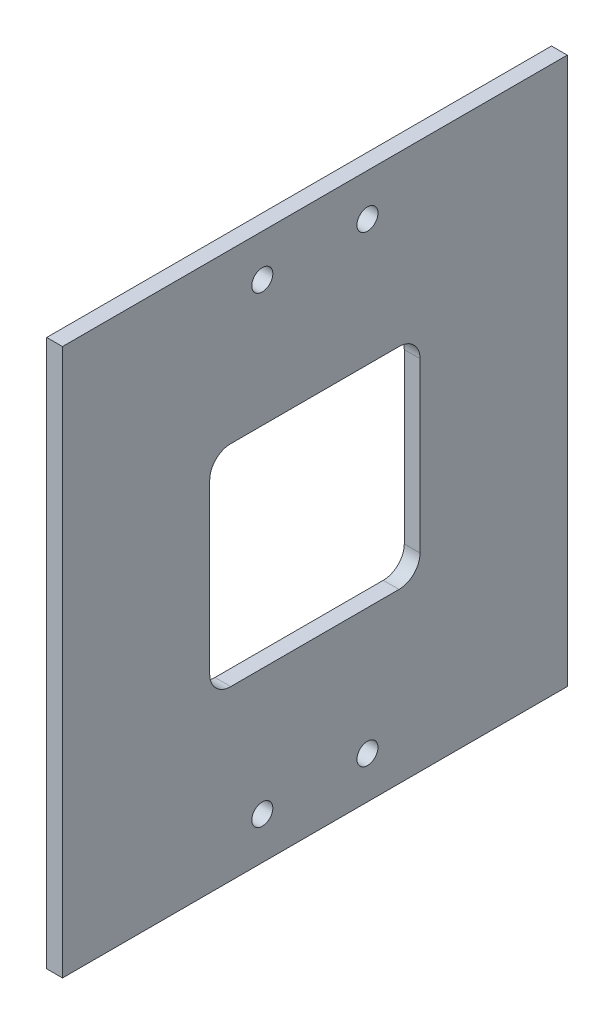
ISO-10303-21;
HEADER;
FILE_DESCRIPTION(('STEP AP214'),'2;1');
FILE_NAME('part.step','',(''),(''),'','','');
FILE_SCHEMA(('AUTOMOTIVE_DESIGN { 1 0 10303 214 1 1 1 1 }'));
ENDSEC;
DATA;
#1=APPLICATION_CONTEXT('core data for automotive mechanical design processes');
#2=APPLICATION_PROTOCOL_DEFINITION('international standard','automotive_design',2000,#1);
#3=PRODUCT_CONTEXT('',#1,'mechanical');
#4=PRODUCT('Part','Part','',(#3));
#5=PRODUCT_RELATED_PRODUCT_CATEGORY('part','',(#4));
#6=PRODUCT_DEFINITION_FORMATION('','',#4);
#7=PRODUCT_DEFINITION_CONTEXT('part definition',#1,'design');
#8=PRODUCT_DEFINITION('design','',#6,#7);
#9=PRODUCT_DEFINITION_SHAPE('','',#8);
#10=(LENGTH_UNIT() NAMED_UNIT(*) SI_UNIT(.MILLI.,.METRE.));
#11=(NAMED_UNIT(*) PLANE_ANGLE_UNIT() SI_UNIT($,.RADIAN.));
#12=(NAMED_UNIT(*) SI_UNIT($,.STERADIAN.) SOLID_ANGLE_UNIT());
#13=UNCERTAINTY_MEASURE_WITH_UNIT(LENGTH_MEASURE(1.E-05),#10,'distance_accuracy_value','');
#14=(GEOMETRIC_REPRESENTATION_CONTEXT(3) GLOBAL_UNCERTAINTY_ASSIGNED_CONTEXT((#13)) GLOBAL_UNIT_ASSIGNED_CONTEXT((#10,
#11,#12)) REPRESENTATION_CONTEXT('',''));
#15=CARTESIAN_POINT('',(0.,0.,0.));
#16=DIRECTION('',(0.,0.,1.));
#17=DIRECTION('',(1.,0.,0.));
#18=AXIS2_PLACEMENT_3D('',#15,#16,#17);
#19=CARTESIAN_POINT('',(4.7625,82.55,0.));
#20=DIRECTION('',(0.,0.,-1.));
#21=DIRECTION('',(0.,1.,0.));
#22=AXIS2_PLACEMENT_3D('',#19,#20,#21);
#23=PLANE('',#22);
#24=DIRECTION('',(0.,-1.,0.));
#25=VECTOR('',#24,1.);
#26=CARTESIAN_POINT('',(0.,82.55,0.));
#27=LINE('',#26,#25);
#28=CARTESIAN_POINT('',(0.,82.55,0.));
#29=VERTEX_POINT('',#28);
#30=CARTESIAN_POINT('',(0.,-82.55,0.));
#31=VERTEX_POINT('',#30);
#32=EDGE_CURVE('E207',#29,#31,#27,.T.);
#33=ORIENTED_EDGE('',*,*,#32,.T.);
#34=DIRECTION('',(-1.,0.,0.));
#35=VECTOR('',#34,1.);
#36=CARTESIAN_POINT('',(4.7625,-82.55,0.));
#37=LINE('',#36,#35);
#38=CARTESIAN_POINT('',(4.7625,-82.55,0.));
#39=VERTEX_POINT('',#38);
#40=EDGE_CURVE('E11',#39,#31,#37,.T.);
#41=ORIENTED_EDGE('',*,*,#40,.F.);
#42=DIRECTION('',(0.,-1.,0.));
#43=VECTOR('',#42,1.);
#44=CARTESIAN_POINT('',(4.7625,82.55,0.));
#45=LINE('',#44,#43);
#46=CARTESIAN_POINT('',(4.7625,82.55,0.));
#47=VERTEX_POINT('',#46);
#48=EDGE_CURVE('E222',#47,#39,#45,.T.);
#49=ORIENTED_EDGE('',*,*,#48,.F.);
#50=DIRECTION('',(-1.,0.,0.));
#51=VECTOR('',#50,1.);
#52=CARTESIAN_POINT('',(4.7625,82.55,0.));
#53=LINE('',#52,#51);
#54=EDGE_CURVE('E235',#47,#29,#53,.T.);
#55=ORIENTED_EDGE('',*,*,#54,.T.);
#56=EDGE_LOOP('',(#33,#41,#49,#55));
#57=FACE_BOUND('',#56,.T.);
#58=ADVANCED_FACE('F37',(#57),#23,.F.);
#59=CARTESIAN_POINT('',(4.7625,-82.55,-152.4));
#60=DIRECTION('',(0.,1.,0.));
#61=DIRECTION('',(0.,0.,1.));
#62=AXIS2_PLACEMENT_3D('',#59,#60,#61);
#63=PLANE('',#62);
#64=DIRECTION('',(0.,0.,-1.));
#65=VECTOR('',#64,1.);
#66=CARTESIAN_POINT('',(0.,-82.55,-152.4));
#67=LINE('',#66,#65);
#68=CARTESIAN_POINT('',(0.,-82.55,-152.4));
#69=VERTEX_POINT('',#68);
#70=EDGE_CURVE('E239',#31,#69,#67,.T.);
#71=ORIENTED_EDGE('',*,*,#70,.T.);
#72=DIRECTION('',(-1.,0.,0.));
#73=VECTOR('',#72,1.);
#74=CARTESIAN_POINT('',(4.7625,-82.55,-152.4));
#75=LINE('',#74,#73);
#76=CARTESIAN_POINT('',(4.7625,-82.55,-152.4));
#77=VERTEX_POINT('',#76);
#78=EDGE_CURVE('E44',#77,#69,#75,.T.);
#79=ORIENTED_EDGE('',*,*,#78,.F.);
#80=DIRECTION('',(0.,0.,-1.));
#81=VECTOR('',#80,1.);
#82=CARTESIAN_POINT('',(4.7625,-82.55,-152.4));
#83=LINE('',#82,#81);
#84=EDGE_CURVE('E226',#39,#77,#83,.T.);
#85=ORIENTED_EDGE('',*,*,#84,.F.);
#86=ORIENTED_EDGE('',*,*,#40,.T.);
#87=EDGE_LOOP('',(#71,#79,#85,#86));
#88=FACE_BOUND('',#87,.T.);
#89=ADVANCED_FACE('F269',(#88),#63,.F.);
#90=CARTESIAN_POINT('',(4.7625,82.55,-152.4));
#91=DIRECTION('',(0.,0.,1.));
#92=DIRECTION('',(0.,-1.,0.));
#93=AXIS2_PLACEMENT_3D('',#90,#91,#92);
#94=PLANE('',#93);
#95=DIRECTION('',(0.,1.,0.));
#96=VECTOR('',#95,1.);
#97=CARTESIAN_POINT('',(0.,82.55,-152.4));
#98=LINE('',#97,#96);
#99=CARTESIAN_POINT('',(0.,82.55,-152.4));
#100=VERTEX_POINT('',#99);
#101=EDGE_CURVE('E242',#69,#100,#98,.T.);
#102=ORIENTED_EDGE('',*,*,#101,.T.);
#103=DIRECTION('',(-1.,0.,0.));
#104=VECTOR('',#103,1.);
#105=CARTESIAN_POINT('',(4.7625,82.55,-152.4));
#106=LINE('',#105,#104);
#107=CARTESIAN_POINT('',(4.7625,82.55,-152.4));
#108=VERTEX_POINT('',#107);
#109=EDGE_CURVE('E248',#108,#100,#106,.T.);
#110=ORIENTED_EDGE('',*,*,#109,.F.);
#111=DIRECTION('',(0.,1.,0.));
#112=VECTOR('',#111,1.);
#113=CARTESIAN_POINT('',(4.7625,82.55,-152.4));
#114=LINE('',#113,#112);
#115=EDGE_CURVE('E230',#77,#108,#114,.T.);
#116=ORIENTED_EDGE('',*,*,#115,.F.);
#117=ORIENTED_EDGE('',*,*,#78,.T.);
#118=EDGE_LOOP('',(#102,#110,#116,#117));
#119=FACE_BOUND('',#118,.T.);
#120=ADVANCED_FACE('F255',(#119),#94,.F.);
#121=CARTESIAN_POINT('',(4.7625,82.55,-152.4));
#122=DIRECTION('',(0.,-1.,0.));
#123=DIRECTION('',(0.,0.,-1.));
#124=AXIS2_PLACEMENT_3D('',#121,#122,#123);
#125=PLANE('',#124);
#126=DIRECTION('',(0.,0.,1.));
#127=VECTOR('',#126,1.);
#128=CARTESIAN_POINT('',(0.,82.55,-152.4));
#129=LINE('',#128,#127);
#130=EDGE_CURVE('E227',#100,#29,#129,.T.);
#131=ORIENTED_EDGE('',*,*,#130,.T.);
#132=ORIENTED_EDGE('',*,*,#54,.F.);
#133=DIRECTION('',(0.,0.,1.));
#134=VECTOR('',#133,1.);
#135=CARTESIAN_POINT('',(4.7625,82.55,-152.4));
#136=LINE('',#135,#134);
#137=EDGE_CURVE('E232',#108,#47,#136,.T.);
#138=ORIENTED_EDGE('',*,*,#137,.F.);
#139=ORIENTED_EDGE('',*,*,#109,.T.);
#140=EDGE_LOOP('',(#131,#132,#138,#139));
#141=FACE_BOUND('',#140,.T.);
#142=ADVANCED_FACE('F264',(#141),#125,.F.);
#143=CARTESIAN_POINT('',(4.7625,-82.55,0.));
#144=DIRECTION('',(-1.,0.,0.));
#145=DIRECTION('',(0.,0.,1.));
#146=AXIS2_PLACEMENT_3D('',#143,#144,#145);
#147=PLANE('',#146);
#148=CARTESIAN_POINT('',(4.7625,-69.85,-60.325));
#149=DIRECTION('',(-1.,0.,0.));
#150=DIRECTION('',(0.,0.,1.));
#151=AXIS2_PLACEMENT_3D('',#148,#149,#150);
#152=CIRCLE('',#151,3.175);
#153=CARTESIAN_POINT('',(4.7625,-69.85,-57.15));
#154=VERTEX_POINT('',#153);
#155=EDGE_CURVE('E332',#154,#154,#152,.T.);
#156=ORIENTED_EDGE('',*,*,#155,.T.);
#157=EDGE_LOOP('',(#156));
#158=FACE_BOUND('',#157,.T.);
#159=CARTESIAN_POINT('',(4.7625,-69.85,-92.075));
#160=DIRECTION('',(-1.,0.,0.));
#161=DIRECTION('',(0.,0.,1.));
#162=AXIS2_PLACEMENT_3D('',#159,#160,#161);
#163=CIRCLE('',#162,3.175);
#164=CARTESIAN_POINT('',(4.7625,-69.85,-88.9));
#165=VERTEX_POINT('',#164);
#166=EDGE_CURVE('E342',#165,#165,#163,.T.);
#167=ORIENTED_EDGE('',*,*,#166,.T.);
#168=EDGE_LOOP('',(#167));
#169=FACE_BOUND('',#168,.T.);
#170=CARTESIAN_POINT('',(4.7625,69.85,-92.075));
#171=DIRECTION('',(-1.,0.,0.));
#172=DIRECTION('',(0.,0.,1.));
#173=AXIS2_PLACEMENT_3D('',#170,#171,#172);
#174=CIRCLE('',#173,3.175);
#175=CARTESIAN_POINT('',(4.7625,69.85,-88.9));
#176=VERTEX_POINT('',#175);
#177=EDGE_CURVE('E349',#176,#176,#174,.T.);
#178=ORIENTED_EDGE('',*,*,#177,.T.);
#179=EDGE_LOOP('',(#178));
#180=FACE_BOUND('',#179,.T.);
#181=CARTESIAN_POINT('',(4.7625,69.85,-60.325));
#182=DIRECTION('',(-1.,0.,0.));
#183=DIRECTION('',(0.,0.,1.));
#184=AXIS2_PLACEMENT_3D('',#181,#182,#183);
#185=CIRCLE('',#184,3.175);
#186=CARTESIAN_POINT('',(4.7625,69.85,-57.15));
#187=VERTEX_POINT('',#186);
#188=EDGE_CURVE('E185',#187,#187,#185,.T.);
#189=ORIENTED_EDGE('',*,*,#188,.T.);
#190=EDGE_LOOP('',(#189));
#191=FACE_BOUND('',#190,.T.);
#192=CARTESIAN_POINT('',(4.7625,-25.4,-101.6));
#193=DIRECTION('',(-1.,0.,0.));
#194=DIRECTION('',(0.,0.,1.));
#195=AXIS2_PLACEMENT_3D('',#192,#193,#194);
#196=CIRCLE('',#195,6.35000000000001);
#197=CARTESIAN_POINT('',(4.7625,-25.4,-107.95));
#198=VERTEX_POINT('',#197);
#199=CARTESIAN_POINT('',(4.7625,-31.75,-101.6));
#200=VERTEX_POINT('',#199);
#201=EDGE_CURVE('E143',#198,#200,#196,.T.);
#202=ORIENTED_EDGE('',*,*,#201,.T.);
#203=DIRECTION('',(0.,0.,1.));
#204=VECTOR('',#203,1.);
#205=CARTESIAN_POINT('',(4.7625,-31.75,-76.2));
#206=LINE('',#205,#204);
#207=CARTESIAN_POINT('',(4.7625,-31.75,-50.8));
#208=VERTEX_POINT('',#207);
#209=EDGE_CURVE('E136',#200,#208,#206,.T.);
#210=ORIENTED_EDGE('',*,*,#209,.T.);
#211=CARTESIAN_POINT('',(4.7625,-25.4,-50.8));
#212=DIRECTION('',(-1.,0.,0.));
#213=DIRECTION('',(0.,0.,1.));
#214=AXIS2_PLACEMENT_3D('',#211,#212,#213);
#215=CIRCLE('',#214,6.35000000000001);
#216=CARTESIAN_POINT('',(4.7625,-25.4,-44.45));
#217=VERTEX_POINT('',#216);
#218=EDGE_CURVE('E146',#208,#217,#215,.T.);
#219=ORIENTED_EDGE('',*,*,#218,.T.);
#220=DIRECTION('',(0.,1.,0.));
#221=VECTOR('',#220,1.);
#222=CARTESIAN_POINT('',(4.7625,-174.906065520897,-44.45));
#223=LINE('',#222,#221);
#224=CARTESIAN_POINT('',(4.7625,25.4,-44.45));
#225=VERTEX_POINT('',#224);
#226=EDGE_CURVE('E54',#217,#225,#223,.T.);
#227=ORIENTED_EDGE('',*,*,#226,.T.);
#228=CARTESIAN_POINT('',(4.7625,25.4,-50.8));
#229=DIRECTION('',(-1.,0.,0.));
#230=DIRECTION('',(0.,0.,1.));
#231=AXIS2_PLACEMENT_3D('',#228,#229,#230);
#232=CIRCLE('',#231,6.35000000000001);
#233=CARTESIAN_POINT('',(4.7625,31.75,-50.8));
#234=VERTEX_POINT('',#233);
#235=EDGE_CURVE('E168',#225,#234,#232,.T.);
#236=ORIENTED_EDGE('',*,*,#235,.T.);
#237=DIRECTION('',(0.,0.,-1.));
#238=VECTOR('',#237,1.);
#239=CARTESIAN_POINT('',(4.7625,31.75,-76.2));
#240=LINE('',#239,#238);
#241=CARTESIAN_POINT('',(4.7625,31.75,-101.6));
#242=VERTEX_POINT('',#241);
#243=EDGE_CURVE('E172',#234,#242,#240,.T.);
#244=ORIENTED_EDGE('',*,*,#243,.T.);
#245=CARTESIAN_POINT('',(4.7625,25.4,-101.6));
#246=DIRECTION('',(-1.,0.,0.));
#247=DIRECTION('',(0.,0.,1.));
#248=AXIS2_PLACEMENT_3D('',#245,#246,#247);
#249=CIRCLE('',#248,6.35000000000001);
#250=CARTESIAN_POINT('',(4.7625,25.4,-107.95));
#251=VERTEX_POINT('',#250);
#252=EDGE_CURVE('E176',#242,#251,#249,.T.);
#253=ORIENTED_EDGE('',*,*,#252,.T.);
#254=DIRECTION('',(0.,-1.,0.));
#255=VECTOR('',#254,1.);
#256=CARTESIAN_POINT('',(4.7625,-174.906065520897,-107.95));
#257=LINE('',#256,#255);
#258=EDGE_CURVE('E179',#251,#198,#257,.T.);
#259=ORIENTED_EDGE('',*,*,#258,.T.);
#260=EDGE_LOOP('',(#202,#210,#219,#227,#236,#244,#253,#259));
#261=FACE_BOUND('',#260,.T.);
#262=ORIENTED_EDGE('',*,*,#48,.T.);
#263=ORIENTED_EDGE('',*,*,#84,.T.);
#264=ORIENTED_EDGE('',*,*,#115,.T.);
#265=ORIENTED_EDGE('',*,*,#137,.T.);
#266=EDGE_LOOP('',(#262,#263,#264,#265));
#267=FACE_BOUND('',#266,.T.);
#268=ADVANCED_FACE('F151',(#158,#169,#180,#191,#261,#267),#147,.F.);
#269=CARTESIAN_POINT('',(0.,-82.55,0.));
#270=DIRECTION('',(-1.,0.,0.));
#271=DIRECTION('',(0.,0.,1.));
#272=AXIS2_PLACEMENT_3D('',#269,#270,#271);
#273=PLANE('',#272);
#274=CARTESIAN_POINT('',(0.,-69.85,-60.325));
#275=DIRECTION('',(-1.,0.,0.));
#276=DIRECTION('',(0.,0.,1.));
#277=AXIS2_PLACEMENT_3D('',#274,#275,#276);
#278=CIRCLE('',#277,3.175);
#279=CARTESIAN_POINT('',(0.,-69.85,-57.15));
#280=VERTEX_POINT('',#279);
#281=EDGE_CURVE('E335',#280,#280,#278,.T.);
#282=ORIENTED_EDGE('',*,*,#281,.F.);
#283=EDGE_LOOP('',(#282));
#284=FACE_BOUND('',#283,.T.);
#285=CARTESIAN_POINT('',(0.,-69.85,-92.075));
#286=DIRECTION('',(-1.,0.,0.));
#287=DIRECTION('',(0.,0.,1.));
#288=AXIS2_PLACEMENT_3D('',#285,#286,#287);
#289=CIRCLE('',#288,3.175);
#290=CARTESIAN_POINT('',(0.,-69.85,-88.9));
#291=VERTEX_POINT('',#290);
#292=EDGE_CURVE('E339',#291,#291,#289,.T.);
#293=ORIENTED_EDGE('',*,*,#292,.F.);
#294=EDGE_LOOP('',(#293));
#295=FACE_BOUND('',#294,.T.);
#296=CARTESIAN_POINT('',(0.,69.85,-92.075));
#297=DIRECTION('',(-1.,0.,0.));
#298=DIRECTION('',(0.,0.,1.));
#299=AXIS2_PLACEMENT_3D('',#296,#297,#298);
#300=CIRCLE('',#299,3.175);
#301=CARTESIAN_POINT('',(0.,69.85,-88.9));
#302=VERTEX_POINT('',#301);
#303=EDGE_CURVE('E345',#302,#302,#300,.T.);
#304=ORIENTED_EDGE('',*,*,#303,.F.);
#305=EDGE_LOOP('',(#304));
#306=FACE_BOUND('',#305,.T.);
#307=CARTESIAN_POINT('',(0.,69.85,-60.325));
#308=DIRECTION('',(-1.,0.,0.));
#309=DIRECTION('',(0.,0.,1.));
#310=AXIS2_PLACEMENT_3D('',#307,#308,#309);
#311=CIRCLE('',#310,3.175);
#312=CARTESIAN_POINT('',(0.,69.85,-57.15));
#313=VERTEX_POINT('',#312);
#314=EDGE_CURVE('E163',#313,#313,#311,.T.);
#315=ORIENTED_EDGE('',*,*,#314,.F.);
#316=EDGE_LOOP('',(#315));
#317=FACE_BOUND('',#316,.T.);
#318=DIRECTION('',(0.,0.,1.));
#319=VECTOR('',#318,1.);
#320=CARTESIAN_POINT('',(0.,-31.75,-76.2));
#321=LINE('',#320,#319);
#322=CARTESIAN_POINT('',(0.,-31.75,-101.6));
#323=VERTEX_POINT('',#322);
#324=CARTESIAN_POINT('',(0.,-31.75,-50.8));
#325=VERTEX_POINT('',#324);
#326=EDGE_CURVE('E63',#323,#325,#321,.T.);
#327=ORIENTED_EDGE('',*,*,#326,.F.);
#328=CARTESIAN_POINT('',(0.,-25.4,-101.6));
#329=DIRECTION('',(-1.,0.,0.));
#330=DIRECTION('',(0.,0.,1.));
#331=AXIS2_PLACEMENT_3D('',#328,#329,#330);
#332=CIRCLE('',#331,6.35000000000001);
#333=CARTESIAN_POINT('',(0.,-25.4,-107.95));
#334=VERTEX_POINT('',#333);
#335=EDGE_CURVE('E156',#334,#323,#332,.T.);
#336=ORIENTED_EDGE('',*,*,#335,.F.);
#337=DIRECTION('',(0.,-1.,0.));
#338=VECTOR('',#337,1.);
#339=CARTESIAN_POINT('',(0.,-174.906065520897,-107.95));
#340=LINE('',#339,#338);
#341=CARTESIAN_POINT('',(0.,25.4,-107.95));
#342=VERTEX_POINT('',#341);
#343=EDGE_CURVE('E160',#342,#334,#340,.T.);
#344=ORIENTED_EDGE('',*,*,#343,.F.);
#345=CARTESIAN_POINT('',(0.,25.4,-101.6));
#346=DIRECTION('',(-1.,0.,0.));
#347=DIRECTION('',(0.,0.,1.));
#348=AXIS2_PLACEMENT_3D('',#345,#346,#347);
#349=CIRCLE('',#348,6.35000000000001);
#350=CARTESIAN_POINT('',(0.,31.75,-101.6));
#351=VERTEX_POINT('',#350);
#352=EDGE_CURVE('E200',#351,#342,#349,.T.);
#353=ORIENTED_EDGE('',*,*,#352,.F.);
#354=DIRECTION('',(0.,0.,-1.));
#355=VECTOR('',#354,1.);
#356=CARTESIAN_POINT('',(0.,31.75,-76.2));
#357=LINE('',#356,#355);
#358=CARTESIAN_POINT('',(0.,31.75,-50.8));
#359=VERTEX_POINT('',#358);
#360=EDGE_CURVE('E196',#359,#351,#357,.T.);
#361=ORIENTED_EDGE('',*,*,#360,.F.);
#362=CARTESIAN_POINT('',(0.,25.4,-50.8));
#363=DIRECTION('',(-1.,0.,0.));
#364=DIRECTION('',(0.,0.,1.));
#365=AXIS2_PLACEMENT_3D('',#362,#363,#364);
#366=CIRCLE('',#365,6.35000000000001);
#367=CARTESIAN_POINT('',(0.,25.4,-44.45));
#368=VERTEX_POINT('',#367);
#369=EDGE_CURVE('E192',#368,#359,#366,.T.);
#370=ORIENTED_EDGE('',*,*,#369,.F.);
#371=DIRECTION('',(0.,1.,0.));
#372=VECTOR('',#371,1.);
#373=CARTESIAN_POINT('',(0.,-174.906065520897,-44.45));
#374=LINE('',#373,#372);
#375=CARTESIAN_POINT('',(0.,-25.4,-44.45));
#376=VERTEX_POINT('',#375);
#377=EDGE_CURVE('E188',#376,#368,#374,.T.);
#378=ORIENTED_EDGE('',*,*,#377,.F.);
#379=CARTESIAN_POINT('',(0.,-25.4,-50.8));
#380=DIRECTION('',(-1.,0.,0.));
#381=DIRECTION('',(0.,0.,1.));
#382=AXIS2_PLACEMENT_3D('',#379,#380,#381);
#383=CIRCLE('',#382,6.35000000000001);
#384=EDGE_CURVE('E184',#325,#376,#383,.T.);
#385=ORIENTED_EDGE('',*,*,#384,.F.);
#386=EDGE_LOOP('',(#327,#336,#344,#353,#361,#370,#378,#385));
#387=FACE_BOUND('',#386,.T.);
#388=ORIENTED_EDGE('',*,*,#32,.F.);
#389=ORIENTED_EDGE('',*,*,#130,.F.);
#390=ORIENTED_EDGE('',*,*,#101,.F.);
#391=ORIENTED_EDGE('',*,*,#70,.F.);
#392=EDGE_LOOP('',(#388,#389,#390,#391));
#393=FACE_BOUND('',#392,.T.);
#394=ADVANCED_FACE('F261',(#284,#295,#306,#317,#387,#393),#273,.T.);
#395=CARTESIAN_POINT('',(4.7625,-31.75,-76.2));
#396=DIRECTION('',(0.,-1.,0.));
#397=DIRECTION('',(0.,0.,-1.));
#398=AXIS2_PLACEMENT_3D('',#395,#396,#397);
#399=PLANE('',#398);
#400=ORIENTED_EDGE('',*,*,#326,.T.);
#401=DIRECTION('',(-1.,0.,0.));
#402=VECTOR('',#401,1.);
#403=CARTESIAN_POINT('',(4.7625,-31.75,-50.8));
#404=LINE('',#403,#402);
#405=EDGE_CURVE('E132',#208,#325,#404,.T.);
#406=ORIENTED_EDGE('',*,*,#405,.F.);
#407=ORIENTED_EDGE('',*,*,#209,.F.);
#408=DIRECTION('',(-1.,0.,0.));
#409=VECTOR('',#408,1.);
#410=CARTESIAN_POINT('',(4.7625,-31.75,-101.6));
#411=LINE('',#410,#409);
#412=EDGE_CURVE('E205',#200,#323,#411,.T.);
#413=ORIENTED_EDGE('',*,*,#412,.T.);
#414=EDGE_LOOP('',(#400,#406,#407,#413));
#415=FACE_BOUND('',#414,.T.);
#416=ADVANCED_FACE('F134',(#415),#399,.F.);
#417=CARTESIAN_POINT('',(4.7625,-25.4,-101.6));
#418=DIRECTION('',(-1.,0.,0.));
#419=DIRECTION('',(0.,0.,1.));
#420=AXIS2_PLACEMENT_3D('',#417,#418,#419);
#421=CYLINDRICAL_SURFACE('',#420,6.35000000000001);
#422=ORIENTED_EDGE('',*,*,#335,.T.);
#423=ORIENTED_EDGE('',*,*,#412,.F.);
#424=ORIENTED_EDGE('',*,*,#201,.F.);
#425=DIRECTION('',(-1.,0.,0.));
#426=VECTOR('',#425,1.);
#427=CARTESIAN_POINT('',(4.7625,-25.4,-107.95));
#428=LINE('',#427,#426);
#429=EDGE_CURVE('E208',#198,#334,#428,.T.);
#430=ORIENTED_EDGE('',*,*,#429,.T.);
#431=EDGE_LOOP('',(#422,#423,#424,#430));
#432=FACE_BOUND('',#431,.T.);
#433=ADVANCED_FACE('F287',(#432),#421,.F.);
#434=CARTESIAN_POINT('',(4.7625,-174.906065520897,-107.95));
#435=DIRECTION('',(0.,0.,-1.));
#436=DIRECTION('',(-1.,0.,0.));
#437=AXIS2_PLACEMENT_3D('',#434,#435,#436);
#438=PLANE('',#437);
#439=ORIENTED_EDGE('',*,*,#343,.T.);
#440=ORIENTED_EDGE('',*,*,#429,.F.);
#441=ORIENTED_EDGE('',*,*,#258,.F.);
#442=DIRECTION('',(-1.,0.,0.));
#443=VECTOR('',#442,1.);
#444=CARTESIAN_POINT('',(4.7625,25.4,-107.95));
#445=LINE('',#444,#443);
#446=EDGE_CURVE('E210',#251,#342,#445,.T.);
#447=ORIENTED_EDGE('',*,*,#446,.T.);
#448=EDGE_LOOP('',(#439,#440,#441,#447));
#449=FACE_BOUND('',#448,.T.);
#450=ADVANCED_FACE('F305',(#449),#438,.F.);
#451=CARTESIAN_POINT('',(4.7625,25.4,-101.6));
#452=DIRECTION('',(-1.,0.,0.));
#453=DIRECTION('',(0.,0.,1.));
#454=AXIS2_PLACEMENT_3D('',#451,#452,#453);
#455=CYLINDRICAL_SURFACE('',#454,6.35000000000001);
#456=ORIENTED_EDGE('',*,*,#352,.T.);
#457=ORIENTED_EDGE('',*,*,#446,.F.);
#458=ORIENTED_EDGE('',*,*,#252,.F.);
#459=DIRECTION('',(-1.,0.,0.));
#460=VECTOR('',#459,1.);
#461=CARTESIAN_POINT('',(4.7625,31.75,-101.6));
#462=LINE('',#461,#460);
#463=EDGE_CURVE('E212',#242,#351,#462,.T.);
#464=ORIENTED_EDGE('',*,*,#463,.T.);
#465=EDGE_LOOP('',(#456,#457,#458,#464));
#466=FACE_BOUND('',#465,.T.);
#467=ADVANCED_FACE('F301',(#466),#455,.F.);
#468=CARTESIAN_POINT('',(4.7625,31.75,-76.2));
#469=DIRECTION('',(0.,1.,0.));
#470=DIRECTION('',(0.,0.,1.));
#471=AXIS2_PLACEMENT_3D('',#468,#469,#470);
#472=PLANE('',#471);
#473=ORIENTED_EDGE('',*,*,#360,.T.);
#474=ORIENTED_EDGE('',*,*,#463,.F.);
#475=ORIENTED_EDGE('',*,*,#243,.F.);
#476=DIRECTION('',(-1.,0.,0.));
#477=VECTOR('',#476,1.);
#478=CARTESIAN_POINT('',(4.7625,31.75,-50.8));
#479=LINE('',#478,#477);
#480=EDGE_CURVE('E214',#234,#359,#479,.T.);
#481=ORIENTED_EDGE('',*,*,#480,.T.);
#482=EDGE_LOOP('',(#473,#474,#475,#481));
#483=FACE_BOUND('',#482,.T.);
#484=ADVANCED_FACE('F297',(#483),#472,.F.);
#485=CARTESIAN_POINT('',(4.7625,25.4,-50.8));
#486=DIRECTION('',(-1.,0.,0.));
#487=DIRECTION('',(0.,0.,1.));
#488=AXIS2_PLACEMENT_3D('',#485,#486,#487);
#489=CYLINDRICAL_SURFACE('',#488,6.35000000000001);
#490=ORIENTED_EDGE('',*,*,#369,.T.);
#491=ORIENTED_EDGE('',*,*,#480,.F.);
#492=ORIENTED_EDGE('',*,*,#235,.F.);
#493=DIRECTION('',(-1.,0.,0.));
#494=VECTOR('',#493,1.);
#495=CARTESIAN_POINT('',(4.7625,25.4,-44.45));
#496=LINE('',#495,#494);
#497=EDGE_CURVE('E217',#225,#368,#496,.T.);
#498=ORIENTED_EDGE('',*,*,#497,.T.);
#499=EDGE_LOOP('',(#490,#491,#492,#498));
#500=FACE_BOUND('',#499,.T.);
#501=ADVANCED_FACE('F294',(#500),#489,.F.);
#502=CARTESIAN_POINT('',(4.7625,-174.906065520897,-44.45));
#503=DIRECTION('',(0.,0.,1.));
#504=DIRECTION('',(0.,-1.,0.));
#505=AXIS2_PLACEMENT_3D('',#502,#503,#504);
#506=PLANE('',#505);
#507=ORIENTED_EDGE('',*,*,#377,.T.);
#508=ORIENTED_EDGE('',*,*,#497,.F.);
#509=ORIENTED_EDGE('',*,*,#226,.F.);
#510=DIRECTION('',(-1.,0.,0.));
#511=VECTOR('',#510,1.);
#512=CARTESIAN_POINT('',(4.7625,-25.4,-44.45));
#513=LINE('',#512,#511);
#514=EDGE_CURVE('E142',#217,#376,#513,.T.);
#515=ORIENTED_EDGE('',*,*,#514,.T.);
#516=EDGE_LOOP('',(#507,#508,#509,#515));
#517=FACE_BOUND('',#516,.T.);
#518=ADVANCED_FACE('F291',(#517),#506,.F.);
#519=CARTESIAN_POINT('',(4.7625,-25.4,-50.8));
#520=DIRECTION('',(-1.,0.,0.));
#521=DIRECTION('',(0.,0.,1.));
#522=AXIS2_PLACEMENT_3D('',#519,#520,#521);
#523=CYLINDRICAL_SURFACE('',#522,6.35000000000001);
#524=ORIENTED_EDGE('',*,*,#384,.T.);
#525=ORIENTED_EDGE('',*,*,#514,.F.);
#526=ORIENTED_EDGE('',*,*,#218,.F.);
#527=ORIENTED_EDGE('',*,*,#405,.T.);
#528=EDGE_LOOP('',(#524,#525,#526,#527));
#529=FACE_BOUND('',#528,.T.);
#530=ADVANCED_FACE('F147',(#529),#523,.F.);
#531=CARTESIAN_POINT('',(4.7625,69.85,-60.325));
#532=DIRECTION('',(-1.,0.,0.));
#533=DIRECTION('',(0.,0.,1.));
#534=AXIS2_PLACEMENT_3D('',#531,#532,#533);
#535=CYLINDRICAL_SURFACE('',#534,3.175);
#536=ORIENTED_EDGE('',*,*,#188,.F.);
#537=EDGE_LOOP('',(#536));
#538=FACE_BOUND('',#537,.T.);
#539=ORIENTED_EDGE('',*,*,#314,.T.);
#540=EDGE_LOOP('',(#539));
#541=FACE_BOUND('',#540,.T.);
#542=ADVANCED_FACE('F290',(#538,#541),#535,.F.);
#543=CARTESIAN_POINT('',(4.7625,69.85,-92.075));
#544=DIRECTION('',(-1.,0.,0.));
#545=DIRECTION('',(0.,0.,1.));
#546=AXIS2_PLACEMENT_3D('',#543,#544,#545);
#547=CYLINDRICAL_SURFACE('',#546,3.175);
#548=ORIENTED_EDGE('',*,*,#177,.F.);
#549=EDGE_LOOP('',(#548));
#550=FACE_BOUND('',#549,.T.);
#551=ORIENTED_EDGE('',*,*,#303,.T.);
#552=EDGE_LOOP('',(#551));
#553=FACE_BOUND('',#552,.T.);
#554=ADVANCED_FACE('F315',(#550,#553),#547,.F.);
#555=CARTESIAN_POINT('',(4.7625,-69.85,-92.075));
#556=DIRECTION('',(-1.,0.,0.));
#557=DIRECTION('',(0.,0.,1.));
#558=AXIS2_PLACEMENT_3D('',#555,#556,#557);
#559=CYLINDRICAL_SURFACE('',#558,3.175);
#560=ORIENTED_EDGE('',*,*,#166,.F.);
#561=EDGE_LOOP('',(#560));
#562=FACE_BOUND('',#561,.T.);
#563=ORIENTED_EDGE('',*,*,#292,.T.);
#564=EDGE_LOOP('',(#563));
#565=FACE_BOUND('',#564,.T.);
#566=ADVANCED_FACE('F319',(#562,#565),#559,.F.);
#567=CARTESIAN_POINT('',(4.7625,-69.85,-60.325));
#568=DIRECTION('',(-1.,0.,0.));
#569=DIRECTION('',(0.,0.,1.));
#570=AXIS2_PLACEMENT_3D('',#567,#568,#569);
#571=CYLINDRICAL_SURFACE('',#570,3.175);
#572=ORIENTED_EDGE('',*,*,#155,.F.);
#573=EDGE_LOOP('',(#572));
#574=FACE_BOUND('',#573,.T.);
#575=ORIENTED_EDGE('',*,*,#281,.T.);
#576=EDGE_LOOP('',(#575));
#577=FACE_BOUND('',#576,.T.);
#578=ADVANCED_FACE('F323',(#574,#577),#571,.F.);
#579=CLOSED_SHELL('',(#58,#89,#120,#142,#268,#394,#416,#433,#450,#467,#484,#501,#518,#530,#542,
#554,#566,#578));
#580=MANIFOLD_SOLID_BREP('B2',#579);
#581=ADVANCED_BREP_SHAPE_REPRESENTATION('',(#18,#580),#14);
#582=SHAPE_DEFINITION_REPRESENTATION(#9,#581);
ENDSEC;
END-ISO-10303-21;
